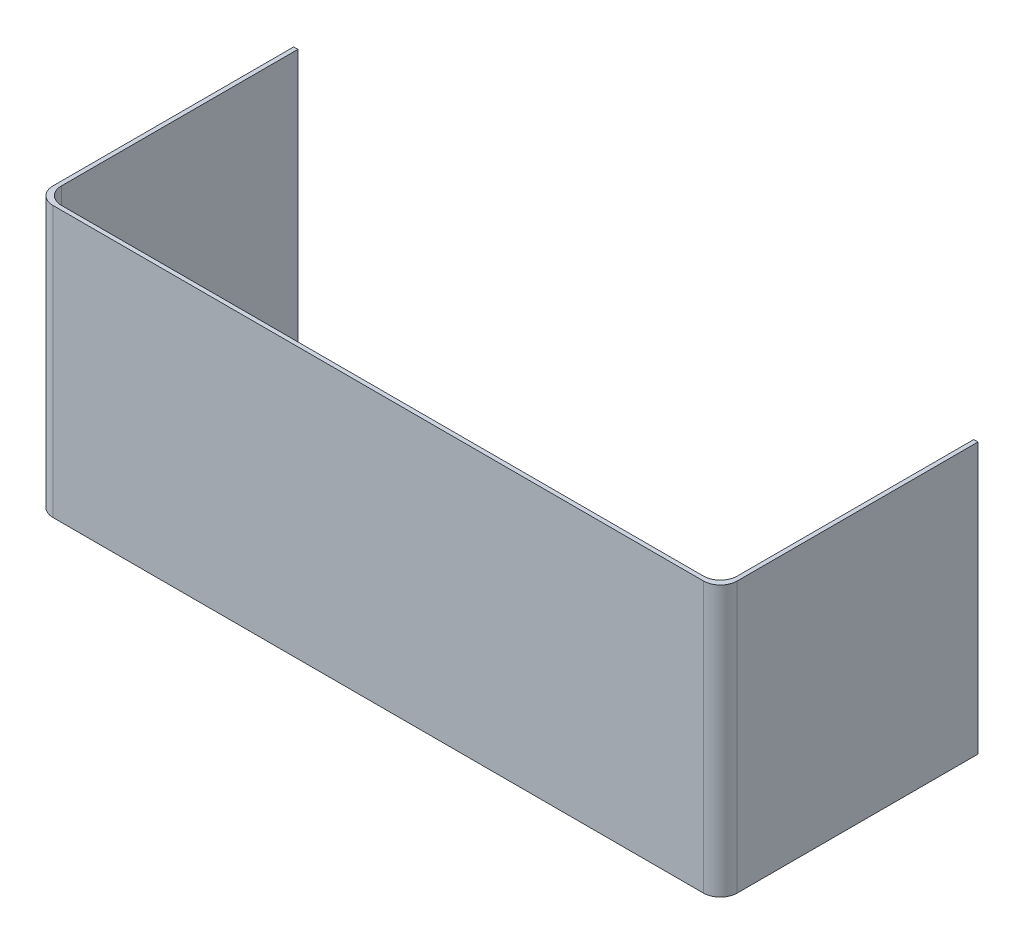
ISO-10303-21;
HEADER;
FILE_DESCRIPTION(('STEP AP214'),'2;1');
FILE_NAME('part.step','',(''),(''),'','','');
FILE_SCHEMA(('AUTOMOTIVE_DESIGN { 1 0 10303 214 1 1 1 1 }'));
ENDSEC;
DATA;
#1=APPLICATION_CONTEXT('core data for automotive mechanical design processes');
#2=APPLICATION_PROTOCOL_DEFINITION('international standard','automotive_design',2000,#1);
#3=PRODUCT_CONTEXT('',#1,'mechanical');
#4=PRODUCT('Part','Part','',(#3));
#5=PRODUCT_RELATED_PRODUCT_CATEGORY('part','',(#4));
#6=PRODUCT_DEFINITION_FORMATION('','',#4);
#7=PRODUCT_DEFINITION_CONTEXT('part definition',#1,'design');
#8=PRODUCT_DEFINITION('design','',#6,#7);
#9=PRODUCT_DEFINITION_SHAPE('','',#8);
#10=(LENGTH_UNIT() NAMED_UNIT(*) SI_UNIT(.MILLI.,.METRE.));
#11=(NAMED_UNIT(*) PLANE_ANGLE_UNIT() SI_UNIT($,.RADIAN.));
#12=(NAMED_UNIT(*) SI_UNIT($,.STERADIAN.) SOLID_ANGLE_UNIT());
#13=UNCERTAINTY_MEASURE_WITH_UNIT(LENGTH_MEASURE(1.E-05),#10,'distance_accuracy_value','');
#14=(GEOMETRIC_REPRESENTATION_CONTEXT(3) GLOBAL_UNCERTAINTY_ASSIGNED_CONTEXT((#13)) GLOBAL_UNIT_ASSIGNED_CONTEXT((#10,
#11,#12)) REPRESENTATION_CONTEXT('',''));
#15=CARTESIAN_POINT('',(0.,0.,0.));
#16=DIRECTION('',(0.,0.,1.));
#17=DIRECTION('',(1.,0.,0.));
#18=AXIS2_PLACEMENT_3D('',#15,#16,#17);
#19=CARTESIAN_POINT('',(-63.5,50.8,-47.625));
#20=DIRECTION('',(-1.,0.,0.));
#21=DIRECTION('',(0.,0.,1.));
#22=AXIS2_PLACEMENT_3D('',#19,#20,#21);
#23=PLANE('',#22);
#24=DIRECTION('',(0.,0.,-1.));
#25=VECTOR('',#24,1.);
#26=CARTESIAN_POINT('',(-63.5,50.8,-47.625));
#27=LINE('',#26,#25);
#28=CARTESIAN_POINT('',(-63.5,50.8,-3.175));
#29=VERTEX_POINT('',#28);
#30=CARTESIAN_POINT('',(-63.5,50.8,-47.625));
#31=VERTEX_POINT('',#30);
#32=EDGE_CURVE('E119',#29,#31,#27,.T.);
#33=ORIENTED_EDGE('',*,*,#32,.F.);
#34=DIRECTION('',(0.,-1.,0.));
#35=VECTOR('',#34,1.);
#36=CARTESIAN_POINT('',(-63.5,0.,-3.175));
#37=LINE('',#36,#35);
#38=CARTESIAN_POINT('',(-63.5,0.,-3.175));
#39=VERTEX_POINT('',#38);
#40=EDGE_CURVE('E164',#29,#39,#37,.T.);
#41=ORIENTED_EDGE('',*,*,#40,.T.);
#42=DIRECTION('',(0.,0.,-1.));
#43=VECTOR('',#42,1.);
#44=CARTESIAN_POINT('',(-63.5,0.,-47.625));
#45=LINE('',#44,#43);
#46=CARTESIAN_POINT('',(-63.5,0.,-47.625));
#47=VERTEX_POINT('',#46);
#48=EDGE_CURVE('E140',#39,#47,#45,.T.);
#49=ORIENTED_EDGE('',*,*,#48,.T.);
#50=DIRECTION('',(0.,-1.,0.));
#51=VECTOR('',#50,1.);
#52=CARTESIAN_POINT('',(-63.5,50.8,-47.625));
#53=LINE('',#52,#51);
#54=EDGE_CURVE('E133',#31,#47,#53,.T.);
#55=ORIENTED_EDGE('',*,*,#54,.F.);
#56=EDGE_LOOP('',(#33,#41,#49,#55));
#57=FACE_BOUND('',#56,.T.);
#58=ADVANCED_FACE('F32',(#57),#23,.F.);
#59=CARTESIAN_POINT('',(-64.29375,50.8,-47.625));
#60=DIRECTION('',(0.,0.,1.));
#61=DIRECTION('',(1.,0.,0.));
#62=AXIS2_PLACEMENT_3D('',#59,#60,#61);
#63=PLANE('',#62);
#64=DIRECTION('',(-1.,0.,0.));
#65=VECTOR('',#64,1.);
#66=CARTESIAN_POINT('',(-64.29375,0.,-47.625));
#67=LINE('',#66,#65);
#68=CARTESIAN_POINT('',(-64.29375,0.,-47.625));
#69=VERTEX_POINT('',#68);
#70=EDGE_CURVE('E199',#47,#69,#67,.T.);
#71=ORIENTED_EDGE('',*,*,#70,.T.);
#72=DIRECTION('',(0.,-1.,0.));
#73=VECTOR('',#72,1.);
#74=CARTESIAN_POINT('',(-64.29375,50.8,-47.625));
#75=LINE('',#74,#73);
#76=CARTESIAN_POINT('',(-64.29375,50.8,-47.625));
#77=VERTEX_POINT('',#76);
#78=EDGE_CURVE('E135',#77,#69,#75,.T.);
#79=ORIENTED_EDGE('',*,*,#78,.F.);
#80=DIRECTION('',(-1.,0.,0.));
#81=VECTOR('',#80,1.);
#82=CARTESIAN_POINT('',(-64.29375,50.8,-47.625));
#83=LINE('',#82,#81);
#84=EDGE_CURVE('E124',#31,#77,#83,.T.);
#85=ORIENTED_EDGE('',*,*,#84,.F.);
#86=ORIENTED_EDGE('',*,*,#54,.T.);
#87=EDGE_LOOP('',(#71,#79,#85,#86));
#88=FACE_BOUND('',#87,.T.);
#89=ADVANCED_FACE('F132',(#88),#63,.F.);
#90=CARTESIAN_POINT('',(-64.29375,50.8,-47.625));
#91=DIRECTION('',(1.,0.,0.));
#92=DIRECTION('',(0.,0.,-1.));
#93=AXIS2_PLACEMENT_3D('',#90,#91,#92);
#94=PLANE('',#93);
#95=DIRECTION('',(0.,0.,1.));
#96=VECTOR('',#95,1.);
#97=CARTESIAN_POINT('',(-64.29375,0.,-47.625));
#98=LINE('',#97,#96);
#99=CARTESIAN_POINT('',(-64.29375,0.,-2.38124999999999));
#100=VERTEX_POINT('',#99);
#101=EDGE_CURVE('E195',#69,#100,#98,.T.);
#102=ORIENTED_EDGE('',*,*,#101,.T.);
#103=DIRECTION('',(0.,-1.,0.));
#104=VECTOR('',#103,1.);
#105=CARTESIAN_POINT('',(-64.29375,50.8,-2.38124999999999));
#106=LINE('',#105,#104);
#107=CARTESIAN_POINT('',(-64.29375,50.8,-2.38124999999999));
#108=VERTEX_POINT('',#107);
#109=EDGE_CURVE('E155',#100,#108,#106,.F.);
#110=ORIENTED_EDGE('',*,*,#109,.T.);
#111=DIRECTION('',(0.,0.,1.));
#112=VECTOR('',#111,1.);
#113=CARTESIAN_POINT('',(-64.29375,50.8,-47.625));
#114=LINE('',#113,#112);
#115=EDGE_CURVE('E137',#77,#108,#114,.T.);
#116=ORIENTED_EDGE('',*,*,#115,.F.);
#117=ORIENTED_EDGE('',*,*,#78,.T.);
#118=EDGE_LOOP('',(#102,#110,#116,#117));
#119=FACE_BOUND('',#118,.T.);
#120=ADVANCED_FACE('F198',(#119),#94,.F.);
#121=CARTESIAN_POINT('',(-64.29375,50.8,0.793750000000003));
#122=DIRECTION('',(0.,0.,-1.));
#123=DIRECTION('',(-1.,0.,0.));
#124=AXIS2_PLACEMENT_3D('',#121,#122,#123);
#125=PLANE('',#124);
#126=DIRECTION('',(1.,0.,0.));
#127=VECTOR('',#126,1.);
#128=CARTESIAN_POINT('',(-64.29375,0.,0.793750000000003));
#129=LINE('',#128,#127);
#130=CARTESIAN_POINT('',(-61.11875,0.,0.793750000000003));
#131=VERTEX_POINT('',#130);
#132=CARTESIAN_POINT('',(61.11875,0.,0.793750000000003));
#133=VERTEX_POINT('',#132);
#134=EDGE_CURVE('E196',#131,#133,#129,.T.);
#135=ORIENTED_EDGE('',*,*,#134,.T.);
#136=DIRECTION('',(0.,-1.,0.));
#137=VECTOR('',#136,1.);
#138=CARTESIAN_POINT('',(61.11875,50.8,0.793750000000003));
#139=LINE('',#138,#137);
#140=CARTESIAN_POINT('',(61.11875,50.8,0.793750000000003));
#141=VERTEX_POINT('',#140);
#142=EDGE_CURVE('E153',#133,#141,#139,.F.);
#143=ORIENTED_EDGE('',*,*,#142,.T.);
#144=DIRECTION('',(1.,0.,0.));
#145=VECTOR('',#144,1.);
#146=CARTESIAN_POINT('',(-64.29375,50.8,0.793750000000003));
#147=LINE('',#146,#145);
#148=CARTESIAN_POINT('',(-61.11875,50.8,0.793750000000003));
#149=VERTEX_POINT('',#148);
#150=EDGE_CURVE('E177',#149,#141,#147,.T.);
#151=ORIENTED_EDGE('',*,*,#150,.F.);
#152=DIRECTION('',(0.,-1.,0.));
#153=VECTOR('',#152,1.);
#154=CARTESIAN_POINT('',(-61.11875,50.8,0.793750000000003));
#155=LINE('',#154,#153);
#156=EDGE_CURVE('E145',#149,#131,#155,.T.);
#157=ORIENTED_EDGE('',*,*,#156,.T.);
#158=EDGE_LOOP('',(#135,#143,#151,#157));
#159=FACE_BOUND('',#158,.T.);
#160=ADVANCED_FACE('F184',(#159),#125,.F.);
#161=CARTESIAN_POINT('',(64.29375,50.8,-47.625));
#162=DIRECTION('',(-1.,0.,0.));
#163=DIRECTION('',(0.,0.,1.));
#164=AXIS2_PLACEMENT_3D('',#161,#162,#163);
#165=PLANE('',#164);
#166=DIRECTION('',(0.,0.,-1.));
#167=VECTOR('',#166,1.);
#168=CARTESIAN_POINT('',(64.29375,50.8,-47.625));
#169=LINE('',#168,#167);
#170=CARTESIAN_POINT('',(64.29375,50.8,-2.38124999999999));
#171=VERTEX_POINT('',#170);
#172=CARTESIAN_POINT('',(64.29375,50.8,-47.625));
#173=VERTEX_POINT('',#172);
#174=EDGE_CURVE('E187',#171,#173,#169,.T.);
#175=ORIENTED_EDGE('',*,*,#174,.F.);
#176=DIRECTION('',(0.,-1.,0.));
#177=VECTOR('',#176,1.);
#178=CARTESIAN_POINT('',(64.29375,50.8,-2.38124999999999));
#179=LINE('',#178,#177);
#180=CARTESIAN_POINT('',(64.29375,0.,-2.38124999999999));
#181=VERTEX_POINT('',#180);
#182=EDGE_CURVE('E142',#171,#181,#179,.T.);
#183=ORIENTED_EDGE('',*,*,#182,.T.);
#184=DIRECTION('',(0.,0.,-1.));
#185=VECTOR('',#184,1.);
#186=CARTESIAN_POINT('',(64.29375,0.,-47.625));
#187=LINE('',#186,#185);
#188=CARTESIAN_POINT('',(64.29375,0.,-47.625));
#189=VERTEX_POINT('',#188);
#190=EDGE_CURVE('E201',#181,#189,#187,.T.);
#191=ORIENTED_EDGE('',*,*,#190,.T.);
#192=DIRECTION('',(0.,-1.,0.));
#193=VECTOR('',#192,1.);
#194=CARTESIAN_POINT('',(64.29375,50.8,-47.625));
#195=LINE('',#194,#193);
#196=EDGE_CURVE('E147',#173,#189,#195,.T.);
#197=ORIENTED_EDGE('',*,*,#196,.F.);
#198=EDGE_LOOP('',(#175,#183,#191,#197));
#199=FACE_BOUND('',#198,.T.);
#200=ADVANCED_FACE('F248',(#199),#165,.F.);
#201=CARTESIAN_POINT('',(64.29375,50.8,-47.625));
#202=DIRECTION('',(0.,0.,1.));
#203=DIRECTION('',(1.,0.,0.));
#204=AXIS2_PLACEMENT_3D('',#201,#202,#203);
#205=PLANE('',#204);
#206=DIRECTION('',(-1.,0.,0.));
#207=VECTOR('',#206,1.);
#208=CARTESIAN_POINT('',(64.29375,0.,-47.625));
#209=LINE('',#208,#207);
#210=CARTESIAN_POINT('',(63.5,0.,-47.625));
#211=VERTEX_POINT('',#210);
#212=EDGE_CURVE('E207',#189,#211,#209,.T.);
#213=ORIENTED_EDGE('',*,*,#212,.T.);
#214=DIRECTION('',(0.,-1.,0.));
#215=VECTOR('',#214,1.);
#216=CARTESIAN_POINT('',(63.5,50.8,-47.625));
#217=LINE('',#216,#215);
#218=CARTESIAN_POINT('',(63.5,50.8,-47.625));
#219=VERTEX_POINT('',#218);
#220=EDGE_CURVE('E214',#219,#211,#217,.T.);
#221=ORIENTED_EDGE('',*,*,#220,.F.);
#222=DIRECTION('',(-1.,0.,0.));
#223=VECTOR('',#222,1.);
#224=CARTESIAN_POINT('',(64.29375,50.8,-47.625));
#225=LINE('',#224,#223);
#226=EDGE_CURVE('E224',#173,#219,#225,.T.);
#227=ORIENTED_EDGE('',*,*,#226,.F.);
#228=ORIENTED_EDGE('',*,*,#196,.T.);
#229=EDGE_LOOP('',(#213,#221,#227,#228));
#230=FACE_BOUND('',#229,.T.);
#231=ADVANCED_FACE('F222',(#230),#205,.F.);
#232=CARTESIAN_POINT('',(63.5,50.8,-47.625));
#233=DIRECTION('',(1.,0.,0.));
#234=DIRECTION('',(0.,0.,-1.));
#235=AXIS2_PLACEMENT_3D('',#232,#233,#234);
#236=PLANE('',#235);
#237=DIRECTION('',(0.,0.,1.));
#238=VECTOR('',#237,1.);
#239=CARTESIAN_POINT('',(63.5,0.,-47.625));
#240=LINE('',#239,#238);
#241=CARTESIAN_POINT('',(63.5,0.,-3.17500000000003));
#242=VERTEX_POINT('',#241);
#243=EDGE_CURVE('E209',#211,#242,#240,.T.);
#244=ORIENTED_EDGE('',*,*,#243,.T.);
#245=DIRECTION('',(0.,-1.,0.));
#246=VECTOR('',#245,1.);
#247=CARTESIAN_POINT('',(63.5,50.8,-3.17500000000003));
#248=LINE('',#247,#246);
#249=CARTESIAN_POINT('',(63.5,50.8,-3.17500000000003));
#250=VERTEX_POINT('',#249);
#251=EDGE_CURVE('E162',#242,#250,#248,.F.);
#252=ORIENTED_EDGE('',*,*,#251,.T.);
#253=DIRECTION('',(0.,0.,1.));
#254=VECTOR('',#253,1.);
#255=CARTESIAN_POINT('',(63.5,50.8,-47.625));
#256=LINE('',#255,#254);
#257=EDGE_CURVE('E239',#219,#250,#256,.T.);
#258=ORIENTED_EDGE('',*,*,#257,.F.);
#259=ORIENTED_EDGE('',*,*,#220,.T.);
#260=EDGE_LOOP('',(#244,#252,#258,#259));
#261=FACE_BOUND('',#260,.T.);
#262=ADVANCED_FACE('F231',(#261),#236,.F.);
#263=CARTESIAN_POINT('',(-63.5,50.8,0.));
#264=DIRECTION('',(0.,0.,1.));
#265=DIRECTION('',(1.,0.,0.));
#266=AXIS2_PLACEMENT_3D('',#263,#264,#265);
#267=PLANE('',#266);
#268=DIRECTION('',(-1.,0.,0.));
#269=VECTOR('',#268,1.);
#270=CARTESIAN_POINT('',(-63.5,50.8,0.));
#271=LINE('',#270,#269);
#272=CARTESIAN_POINT('',(60.325,50.8,0.));
#273=VERTEX_POINT('',#272);
#274=CARTESIAN_POINT('',(-60.325,50.8,0.));
#275=VERTEX_POINT('',#274);
#276=EDGE_CURVE('E216',#273,#275,#271,.T.);
#277=ORIENTED_EDGE('',*,*,#276,.F.);
#278=DIRECTION('',(0.,-1.,0.));
#279=VECTOR('',#278,1.);
#280=CARTESIAN_POINT('',(60.325,0.,0.));
#281=LINE('',#280,#279);
#282=CARTESIAN_POINT('',(60.325,0.,0.));
#283=VERTEX_POINT('',#282);
#284=EDGE_CURVE('E159',#273,#283,#281,.T.);
#285=ORIENTED_EDGE('',*,*,#284,.T.);
#286=DIRECTION('',(-1.,0.,0.));
#287=VECTOR('',#286,1.);
#288=CARTESIAN_POINT('',(-63.5,0.,0.));
#289=LINE('',#288,#287);
#290=CARTESIAN_POINT('',(-60.325,0.,0.));
#291=VERTEX_POINT('',#290);
#292=EDGE_CURVE('E128',#283,#291,#289,.T.);
#293=ORIENTED_EDGE('',*,*,#292,.T.);
#294=DIRECTION('',(0.,-1.,0.));
#295=VECTOR('',#294,1.);
#296=CARTESIAN_POINT('',(-60.325,50.8,0.));
#297=LINE('',#296,#295);
#298=EDGE_CURVE('E157',#291,#275,#297,.F.);
#299=ORIENTED_EDGE('',*,*,#298,.T.);
#300=EDGE_LOOP('',(#277,#285,#293,#299));
#301=FACE_BOUND('',#300,.T.);
#302=ADVANCED_FACE('F241',(#301),#267,.F.);
#303=CARTESIAN_POINT('',(0.,50.8,0.));
#304=DIRECTION('',(0.,1.,0.));
#305=DIRECTION('',(0.,0.,1.));
#306=AXIS2_PLACEMENT_3D('',#303,#304,#305);
#307=PLANE('',#306);
#308=ORIENTED_EDGE('',*,*,#150,.T.);
#309=CARTESIAN_POINT('',(61.11875,50.8,-2.38124999999999));
#310=DIRECTION('',(0.,1.,0.));
#311=DIRECTION('',(0.,0.,1.));
#312=AXIS2_PLACEMENT_3D('',#309,#310,#311);
#313=CIRCLE('',#312,3.175);
#314=EDGE_CURVE('E11',#141,#171,#313,.T.);
#315=ORIENTED_EDGE('',*,*,#314,.T.);
#316=ORIENTED_EDGE('',*,*,#174,.T.);
#317=ORIENTED_EDGE('',*,*,#226,.T.);
#318=ORIENTED_EDGE('',*,*,#257,.T.);
#319=CARTESIAN_POINT('',(60.325,50.8,-3.17500000000003));
#320=DIRECTION('',(0.,1.,0.));
#321=DIRECTION('',(0.,0.,1.));
#322=AXIS2_PLACEMENT_3D('',#319,#320,#321);
#323=CIRCLE('',#322,3.175);
#324=EDGE_CURVE('E168',#250,#273,#323,.F.);
#325=ORIENTED_EDGE('',*,*,#324,.T.);
#326=ORIENTED_EDGE('',*,*,#276,.T.);
#327=CARTESIAN_POINT('',(-60.325,50.8,-3.175));
#328=DIRECTION('',(0.,1.,0.));
#329=DIRECTION('',(0.,0.,1.));
#330=AXIS2_PLACEMENT_3D('',#327,#328,#329);
#331=CIRCLE('',#330,3.175);
#332=EDGE_CURVE('E47',#275,#29,#331,.F.);
#333=ORIENTED_EDGE('',*,*,#332,.T.);
#334=ORIENTED_EDGE('',*,*,#32,.T.);
#335=ORIENTED_EDGE('',*,*,#84,.T.);
#336=ORIENTED_EDGE('',*,*,#115,.T.);
#337=CARTESIAN_POINT('',(-61.11875,50.8,-2.38125));
#338=DIRECTION('',(0.,1.,0.));
#339=DIRECTION('',(0.,0.,1.));
#340=AXIS2_PLACEMENT_3D('',#337,#338,#339);
#341=CIRCLE('',#340,3.175);
#342=EDGE_CURVE('E40',#108,#149,#341,.T.);
#343=ORIENTED_EDGE('',*,*,#342,.T.);
#344=EDGE_LOOP('',(#308,#315,#316,#317,#318,#325,#326,#333,#334,#335,#336,#343));
#345=FACE_BOUND('',#344,.T.);
#346=ADVANCED_FACE('F122',(#345),#307,.T.);
#347=CARTESIAN_POINT('',(0.,0.,0.));
#348=DIRECTION('',(0.,1.,0.));
#349=DIRECTION('',(0.,0.,1.));
#350=AXIS2_PLACEMENT_3D('',#347,#348,#349);
#351=PLANE('',#350);
#352=ORIENTED_EDGE('',*,*,#190,.F.);
#353=CARTESIAN_POINT('',(61.11875,0.,-2.38124999999999));
#354=DIRECTION('',(0.,1.,0.));
#355=DIRECTION('',(0.,0.,1.));
#356=AXIS2_PLACEMENT_3D('',#353,#354,#355);
#357=CIRCLE('',#356,3.175);
#358=EDGE_CURVE('E174',#181,#133,#357,.F.);
#359=ORIENTED_EDGE('',*,*,#358,.T.);
#360=ORIENTED_EDGE('',*,*,#134,.F.);
#361=CARTESIAN_POINT('',(-61.11875,0.,-2.38125));
#362=DIRECTION('',(0.,1.,0.));
#363=DIRECTION('',(0.,0.,1.));
#364=AXIS2_PLACEMENT_3D('',#361,#362,#363);
#365=CIRCLE('',#364,3.175);
#366=EDGE_CURVE('E172',#131,#100,#365,.F.);
#367=ORIENTED_EDGE('',*,*,#366,.T.);
#368=ORIENTED_EDGE('',*,*,#101,.F.);
#369=ORIENTED_EDGE('',*,*,#70,.F.);
#370=ORIENTED_EDGE('',*,*,#48,.F.);
#371=CARTESIAN_POINT('',(-60.325,0.,-3.175));
#372=DIRECTION('',(0.,1.,0.));
#373=DIRECTION('',(0.,0.,1.));
#374=AXIS2_PLACEMENT_3D('',#371,#372,#373);
#375=CIRCLE('',#374,3.175);
#376=EDGE_CURVE('E55',#39,#291,#375,.T.);
#377=ORIENTED_EDGE('',*,*,#376,.T.);
#378=ORIENTED_EDGE('',*,*,#292,.F.);
#379=CARTESIAN_POINT('',(60.325,0.,-3.17500000000003));
#380=DIRECTION('',(0.,1.,0.));
#381=DIRECTION('',(0.,0.,1.));
#382=AXIS2_PLACEMENT_3D('',#379,#380,#381);
#383=CIRCLE('',#382,3.175);
#384=EDGE_CURVE('E166',#283,#242,#383,.T.);
#385=ORIENTED_EDGE('',*,*,#384,.T.);
#386=ORIENTED_EDGE('',*,*,#243,.F.);
#387=ORIENTED_EDGE('',*,*,#212,.F.);
#388=EDGE_LOOP('',(#352,#359,#360,#367,#368,#369,#370,#377,#378,#385,#386,#387));
#389=FACE_BOUND('',#388,.T.);
#390=ADVANCED_FACE('F194',(#389),#351,.F.);
#391=CARTESIAN_POINT('',(61.11875,50.8,-2.38124999999999));
#392=DIRECTION('',(0.,-1.,0.));
#393=DIRECTION('',(0.,0.,-1.));
#394=AXIS2_PLACEMENT_3D('',#391,#392,#393);
#395=CYLINDRICAL_SURFACE('',#394,3.175);
#396=ORIENTED_EDGE('',*,*,#314,.F.);
#397=ORIENTED_EDGE('',*,*,#142,.F.);
#398=ORIENTED_EDGE('',*,*,#358,.F.);
#399=ORIENTED_EDGE('',*,*,#182,.F.);
#400=EDGE_LOOP('',(#396,#397,#398,#399));
#401=FACE_BOUND('',#400,.T.);
#402=ADVANCED_FACE('F250',(#401),#395,.T.);
#403=CARTESIAN_POINT('',(-61.11875,50.8,-2.38125));
#404=DIRECTION('',(0.,-1.,0.));
#405=DIRECTION('',(0.,0.,-1.));
#406=AXIS2_PLACEMENT_3D('',#403,#404,#405);
#407=CYLINDRICAL_SURFACE('',#406,3.175);
#408=ORIENTED_EDGE('',*,*,#342,.F.);
#409=ORIENTED_EDGE('',*,*,#109,.F.);
#410=ORIENTED_EDGE('',*,*,#366,.F.);
#411=ORIENTED_EDGE('',*,*,#156,.F.);
#412=EDGE_LOOP('',(#408,#409,#410,#411));
#413=FACE_BOUND('',#412,.T.);
#414=ADVANCED_FACE('F189',(#413),#407,.T.);
#415=CARTESIAN_POINT('',(60.325,50.8,-3.17500000000003));
#416=DIRECTION('',(0.,1.,0.));
#417=DIRECTION('',(0.,0.,1.));
#418=AXIS2_PLACEMENT_3D('',#415,#416,#417);
#419=CYLINDRICAL_SURFACE('',#418,3.175);
#420=ORIENTED_EDGE('',*,*,#324,.F.);
#421=ORIENTED_EDGE('',*,*,#251,.F.);
#422=ORIENTED_EDGE('',*,*,#384,.F.);
#423=ORIENTED_EDGE('',*,*,#284,.F.);
#424=EDGE_LOOP('',(#420,#421,#422,#423));
#425=FACE_BOUND('',#424,.T.);
#426=ADVANCED_FACE('F236',(#425),#419,.F.);
#427=CARTESIAN_POINT('',(-60.325,50.8,-3.175));
#428=DIRECTION('',(0.,1.,0.));
#429=DIRECTION('',(0.,0.,1.));
#430=AXIS2_PLACEMENT_3D('',#427,#428,#429);
#431=CYLINDRICAL_SURFACE('',#430,3.175);
#432=ORIENTED_EDGE('',*,*,#332,.F.);
#433=ORIENTED_EDGE('',*,*,#298,.F.);
#434=ORIENTED_EDGE('',*,*,#376,.F.);
#435=ORIENTED_EDGE('',*,*,#40,.F.);
#436=EDGE_LOOP('',(#432,#433,#434,#435));
#437=FACE_BOUND('',#436,.T.);
#438=ADVANCED_FACE('F34',(#437),#431,.F.);
#439=CLOSED_SHELL('',(#58,#89,#120,#160,#200,#231,#262,#302,#346,#390,#402,#414,#426,#438));
#440=MANIFOLD_SOLID_BREP('B2',#439);
#441=ADVANCED_BREP_SHAPE_REPRESENTATION('',(#18,#440),#14);
#442=SHAPE_DEFINITION_REPRESENTATION(#9,#441);
ENDSEC;
END-ISO-10303-21;
